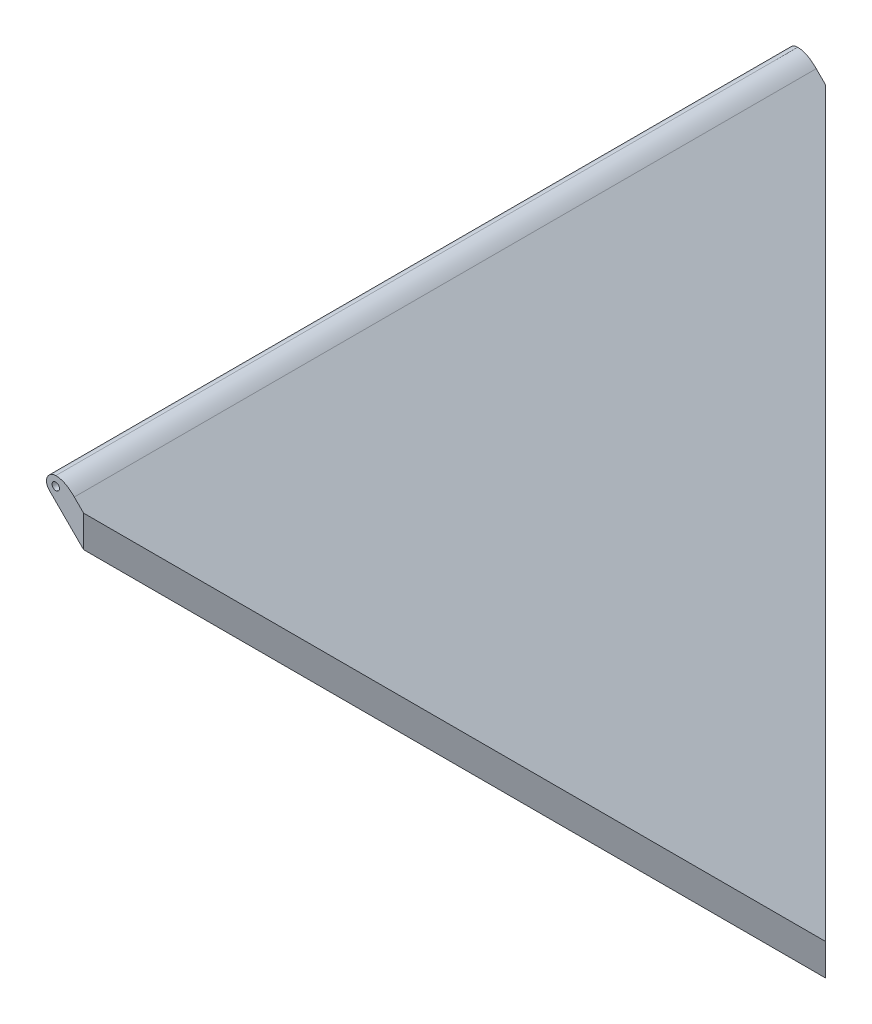
ISO-10303-21;
HEADER;
FILE_DESCRIPTION(('STEP AP214'),'2;1');
FILE_NAME('part.step','',(''),(''),'','','');
FILE_SCHEMA(('AUTOMOTIVE_DESIGN { 1 0 10303 214 1 1 1 1 }'));
ENDSEC;
DATA;
#1=APPLICATION_CONTEXT('core data for automotive mechanical design processes');
#2=APPLICATION_PROTOCOL_DEFINITION('international standard','automotive_design',2000,#1);
#3=PRODUCT_CONTEXT('',#1,'mechanical');
#4=PRODUCT('Part','Part','',(#3));
#5=PRODUCT_RELATED_PRODUCT_CATEGORY('part','',(#4));
#6=PRODUCT_DEFINITION_FORMATION('','',#4);
#7=PRODUCT_DEFINITION_CONTEXT('part definition',#1,'design');
#8=PRODUCT_DEFINITION('design','',#6,#7);
#9=PRODUCT_DEFINITION_SHAPE('','',#8);
#10=(LENGTH_UNIT() NAMED_UNIT(*) SI_UNIT(.MILLI.,.METRE.));
#11=(NAMED_UNIT(*) PLANE_ANGLE_UNIT() SI_UNIT($,.RADIAN.));
#12=(NAMED_UNIT(*) SI_UNIT($,.STERADIAN.) SOLID_ANGLE_UNIT());
#13=UNCERTAINTY_MEASURE_WITH_UNIT(LENGTH_MEASURE(1.E-05),#10,'distance_accuracy_value','');
#14=(GEOMETRIC_REPRESENTATION_CONTEXT(3) GLOBAL_UNCERTAINTY_ASSIGNED_CONTEXT((#13)) GLOBAL_UNIT_ASSIGNED_CONTEXT((#10,
#11,#12)) REPRESENTATION_CONTEXT('',''));
#15=CARTESIAN_POINT('',(0.,0.,0.));
#16=DIRECTION('',(0.,0.,1.));
#17=DIRECTION('',(1.,0.,0.));
#18=AXIS2_PLACEMENT_3D('',#15,#16,#17);
#19=CARTESIAN_POINT('',(0.,0.,0.));
#20=DIRECTION('',(-0.707106781186548,0.,-0.707106781186547));
#21=DIRECTION('',(-0.707106781186547,0.,0.707106781186548));
#22=AXIS2_PLACEMENT_3D('',#19,#20,#21);
#23=PLANE('',#22);
#24=DIRECTION('',(0.,-1.,0.));
#25=VECTOR('',#24,1.);
#26=CARTESIAN_POINT('',(0.,0.,0.));
#27=LINE('',#26,#25);
#28=CARTESIAN_POINT('',(-2.83661982791727E-11,-256.249999999977,2.8421709430404E-11));
#29=VERTEX_POINT('',#28);
#30=CARTESIAN_POINT('',(-2.83939538547884E-11,-277.588834764804,2.8421709430404E-11));
#31=VERTEX_POINT('',#30);
#32=EDGE_CURVE('E168',#29,#31,#27,.T.);
#33=ORIENTED_EDGE('',*,*,#32,.F.);
#34=DIRECTION('',(-0.577350269189622,0.577350269189634,0.577350269189622));
#35=VECTOR('',#34,1.);
#36=CARTESIAN_POINT('',(-91.6666666666691,-164.583333333335,91.6666666666692));
#37=LINE('',#36,#35);
#38=CARTESIAN_POINT('',(-250.,-6.25000000000076,250.));
#39=VERTEX_POINT('',#38);
#40=EDGE_CURVE('E12',#29,#39,#37,.T.);
#41=ORIENTED_EDGE('',*,*,#40,.T.);
#42=DIRECTION('',(0.,1.,0.));
#43=VECTOR('',#42,1.);
#44=CARTESIAN_POINT('',(-250.,-357.97280797569,250.));
#45=LINE('',#44,#43);
#46=CARTESIAN_POINT('',(-250.,-27.5888347648319,250.));
#47=VERTEX_POINT('',#46);
#48=EDGE_CURVE('E60',#47,#39,#45,.T.);
#49=ORIENTED_EDGE('',*,*,#48,.F.);
#50=DIRECTION('',(-0.577350269189625,0.577350269189627,0.577350269189625));
#51=VECTOR('',#50,1.);
#52=CARTESIAN_POINT('',(136.922648807238,-414.511483572071,-136.922648807238));
#53=LINE('',#52,#51);
#54=EDGE_CURVE('E169',#31,#47,#53,.T.);
#55=ORIENTED_EDGE('',*,*,#54,.F.);
#56=EDGE_LOOP('',(#33,#41,#49,#55));
#57=FACE_BOUND('',#56,.T.);
#58=ADVANCED_FACE('F42',(#57),#23,.F.);
#59=CARTESIAN_POINT('',(0.,0.,0.));
#60=DIRECTION('',(0.707106781186547,0.,-0.707106781186548));
#61=DIRECTION('',(-0.707106781186548,0.,-0.707106781186547));
#62=AXIS2_PLACEMENT_3D('',#59,#60,#61);
#63=PLANE('',#62);
#64=ORIENTED_EDGE('',*,*,#32,.T.);
#65=DIRECTION('',(-0.577350269189625,0.577350269189627,-0.577350269189625));
#66=VECTOR('',#65,1.);
#67=CARTESIAN_POINT('',(-29.7440178594283,-247.844816905404,-29.7440178594283));
#68=LINE('',#67,#66);
#69=CARTESIAN_POINT('',(-250.,-27.588834764832,-250.));
#70=VERTEX_POINT('',#69);
#71=EDGE_CURVE('E46',#31,#70,#68,.T.);
#72=ORIENTED_EDGE('',*,*,#71,.T.);
#73=DIRECTION('',(0.,1.,0.));
#74=VECTOR('',#73,1.);
#75=CARTESIAN_POINT('',(-250.,-357.97280797569,-250.));
#76=LINE('',#75,#74);
#77=CARTESIAN_POINT('',(-250.,-6.25000000000038,-250.));
#78=VERTEX_POINT('',#77);
#79=EDGE_CURVE('E52',#70,#78,#76,.T.);
#80=ORIENTED_EDGE('',*,*,#79,.T.);
#81=DIRECTION('',(-0.577350269189622,0.577350269189634,-0.577350269189622));
#82=VECTOR('',#81,1.);
#83=CARTESIAN_POINT('',(-258.333333333334,2.08333333333316,-258.333333333333));
#84=LINE('',#83,#82);
#85=EDGE_CURVE('E104',#29,#78,#84,.T.);
#86=ORIENTED_EDGE('',*,*,#85,.F.);
#87=EDGE_LOOP('',(#64,#72,#80,#86));
#88=FACE_BOUND('',#87,.T.);
#89=ADVANCED_FACE('F44',(#88),#63,.T.);
#90=CARTESIAN_POINT('',(-268.75,0.,-230.));
#91=DIRECTION('',(0.,0.,-1.));
#92=DIRECTION('',(1.,0.,0.));
#93=AXIS2_PLACEMENT_3D('',#90,#91,#92);
#94=PLANE('',#93);
#95=CARTESIAN_POINT('',(-268.75,0.,-230.));
#96=DIRECTION('',(0.,0.,1.));
#97=DIRECTION('',(1.,0.,0.));
#98=AXIS2_PLACEMENT_3D('',#95,#96,#97);
#99=CIRCLE('',#98,2.50000000000002);
#100=CARTESIAN_POINT('',(-266.25,0.,-230.));
#101=VERTEX_POINT('',#100);
#102=EDGE_CURVE('E214',#101,#101,#99,.T.);
#103=ORIENTED_EDGE('',*,*,#102,.F.);
#104=EDGE_LOOP('',(#103));
#105=FACE_BOUND('',#104,.T.);
#106=ADVANCED_FACE('F164',(#105),#94,.T.);
#107=CARTESIAN_POINT('',(-268.75,0.,230.));
#108=DIRECTION('',(0.,0.,1.));
#109=DIRECTION('',(1.,0.,0.));
#110=AXIS2_PLACEMENT_3D('',#107,#108,#109);
#111=PLANE('',#110);
#112=CARTESIAN_POINT('',(-268.75,0.,230.));
#113=DIRECTION('',(0.,0.,1.));
#114=DIRECTION('',(1.,0.,0.));
#115=AXIS2_PLACEMENT_3D('',#112,#113,#114);
#116=CIRCLE('',#115,2.50000000000002);
#117=CARTESIAN_POINT('',(-266.25,0.,230.));
#118=VERTEX_POINT('',#117);
#119=EDGE_CURVE('E123',#118,#118,#116,.T.);
#120=ORIENTED_EDGE('',*,*,#119,.T.);
#121=EDGE_LOOP('',(#120));
#122=FACE_BOUND('',#121,.T.);
#123=ADVANCED_FACE('F232',(#122),#111,.T.);
#124=CARTESIAN_POINT('',(-268.75,0.,-230.));
#125=DIRECTION('',(0.,0.,-1.));
#126=DIRECTION('',(-1.,0.,0.));
#127=AXIS2_PLACEMENT_3D('',#124,#125,#126);
#128=CYLINDRICAL_SURFACE('',#127,2.50000000000002);
#129=ORIENTED_EDGE('',*,*,#102,.T.);
#130=EDGE_LOOP('',(#129));
#131=FACE_BOUND('',#130,.T.);
#132=CARTESIAN_POINT('',(-268.75,0.,-250.));
#133=DIRECTION('',(0.,0.,1.));
#134=DIRECTION('',(1.,0.,0.));
#135=AXIS2_PLACEMENT_3D('',#132,#133,#134);
#136=CIRCLE('',#135,2.50000000000002);
#137=CARTESIAN_POINT('',(-266.25,0.,-250.));
#138=VERTEX_POINT('',#137);
#139=EDGE_CURVE('E173',#138,#138,#136,.T.);
#140=ORIENTED_EDGE('',*,*,#139,.F.);
#141=EDGE_LOOP('',(#140));
#142=FACE_BOUND('',#141,.T.);
#143=ADVANCED_FACE('F149',(#131,#142),#128,.F.);
#144=CARTESIAN_POINT('',(-268.75,0.,-250.));
#145=DIRECTION('',(0.,0.,1.));
#146=DIRECTION('',(1.,0.,0.));
#147=AXIS2_PLACEMENT_3D('',#144,#145,#146);
#148=CYLINDRICAL_SURFACE('',#147,6.25000000000093);
#149=CARTESIAN_POINT('',(-268.75,0.,250.));
#150=DIRECTION('',(0.,0.,1.));
#151=DIRECTION('',(1.,0.,0.));
#152=AXIS2_PLACEMENT_3D('',#149,#150,#151);
#153=CIRCLE('',#152,6.25000000000093);
#154=CARTESIAN_POINT('',(-268.75,6.2500000000007,250.));
#155=VERTEX_POINT('',#154);
#156=CARTESIAN_POINT('',(-273.169417382416,-4.41941738241589,250.));
#157=VERTEX_POINT('',#156);
#158=EDGE_CURVE('E193',#155,#157,#153,.T.);
#159=ORIENTED_EDGE('',*,*,#158,.F.);
#160=DIRECTION('',(0.,0.,1.));
#161=VECTOR('',#160,1.);
#162=CARTESIAN_POINT('',(-268.75,6.25000000000047,-250.));
#163=LINE('',#162,#161);
#164=CARTESIAN_POINT('',(-268.75,6.25000000000093,-250.));
#165=VERTEX_POINT('',#164);
#166=EDGE_CURVE('E106',#165,#155,#163,.T.);
#167=ORIENTED_EDGE('',*,*,#166,.F.);
#168=CARTESIAN_POINT('',(-268.75,0.,-250.));
#169=DIRECTION('',(0.,0.,1.));
#170=DIRECTION('',(1.,0.,0.));
#171=AXIS2_PLACEMENT_3D('',#168,#169,#170);
#172=CIRCLE('',#171,6.25000000000093);
#173=CARTESIAN_POINT('',(-273.169417382417,-4.41941738241642,-250.));
#174=VERTEX_POINT('',#173);
#175=EDGE_CURVE('E121',#165,#174,#172,.T.);
#176=ORIENTED_EDGE('',*,*,#175,.T.);
#177=DIRECTION('',(0.,0.,-1.));
#178=VECTOR('',#177,1.);
#179=CARTESIAN_POINT('',(-273.169417382416,-4.41941738241589,-250.));
#180=LINE('',#179,#178);
#181=EDGE_CURVE('E191',#157,#174,#180,.T.);
#182=ORIENTED_EDGE('',*,*,#181,.F.);
#183=EDGE_LOOP('',(#159,#167,#176,#182));
#184=FACE_BOUND('',#183,.T.);
#185=ADVANCED_FACE('F145',(#184),#148,.T.);
#186=CARTESIAN_POINT('',(80.3839732108572,-357.97280797569,-250.));
#187=DIRECTION('',(0.707106781186549,0.707106781186546,0.));
#188=DIRECTION('',(-0.707106781186546,0.707106781186549,0.));
#189=AXIS2_PLACEMENT_3D('',#186,#187,#188);
#190=PLANE('',#189);
#191=ORIENTED_EDGE('',*,*,#71,.F.);
#192=ORIENTED_EDGE('',*,*,#54,.T.);
#193=DIRECTION('',(-0.707106781186546,0.707106781186549,0.));
#194=VECTOR('',#193,1.);
#195=CARTESIAN_POINT('',(80.3839732108573,-357.97280797569,250.));
#196=LINE('',#195,#194);
#197=EDGE_CURVE('E181',#47,#157,#196,.T.);
#198=ORIENTED_EDGE('',*,*,#197,.T.);
#199=ORIENTED_EDGE('',*,*,#181,.T.);
#200=DIRECTION('',(-0.707106781186546,0.707106781186549,0.));
#201=VECTOR('',#200,1.);
#202=CARTESIAN_POINT('',(80.3839732108572,-357.97280797569,-250.));
#203=LINE('',#202,#201);
#204=EDGE_CURVE('E176',#70,#174,#203,.T.);
#205=ORIENTED_EDGE('',*,*,#204,.F.);
#206=EDGE_LOOP('',(#191,#192,#198,#199,#205));
#207=FACE_BOUND('',#206,.T.);
#208=ADVANCED_FACE('F148',(#207),#190,.F.);
#209=CARTESIAN_POINT('',(-268.75,0.,230.));
#210=DIRECTION('',(0.,0.,1.));
#211=DIRECTION('',(1.,0.,0.));
#212=AXIS2_PLACEMENT_3D('',#209,#210,#211);
#213=CYLINDRICAL_SURFACE('',#212,2.50000000000002);
#214=ORIENTED_EDGE('',*,*,#119,.F.);
#215=EDGE_LOOP('',(#214));
#216=FACE_BOUND('',#215,.T.);
#217=CARTESIAN_POINT('',(-268.75,0.,250.));
#218=DIRECTION('',(0.,0.,1.));
#219=DIRECTION('',(1.,0.,0.));
#220=AXIS2_PLACEMENT_3D('',#217,#218,#219);
#221=CIRCLE('',#220,2.50000000000002);
#222=CARTESIAN_POINT('',(-266.25,0.,250.));
#223=VERTEX_POINT('',#222);
#224=EDGE_CURVE('E127',#223,#223,#221,.T.);
#225=ORIENTED_EDGE('',*,*,#224,.T.);
#226=EDGE_LOOP('',(#225));
#227=FACE_BOUND('',#226,.T.);
#228=ADVANCED_FACE('F141',(#216,#227),#213,.F.);
#229=CARTESIAN_POINT('',(80.3839732108573,-357.97280797569,250.));
#230=DIRECTION('',(0.,0.,-1.));
#231=DIRECTION('',(-1.,0.,0.));
#232=AXIS2_PLACEMENT_3D('',#229,#230,#231);
#233=PLANE('',#232);
#234=ORIENTED_EDGE('',*,*,#224,.F.);
#235=EDGE_LOOP('',(#234));
#236=FACE_BOUND('',#235,.T.);
#237=ORIENTED_EDGE('',*,*,#197,.F.);
#238=ORIENTED_EDGE('',*,*,#48,.T.);
#239=DIRECTION('',(-0.70710678118654,0.707106781186555,0.));
#240=VECTOR('',#239,1.);
#241=CARTESIAN_POINT('',(-262.5,6.24999999999984,250.));
#242=LINE('',#241,#240);
#243=CARTESIAN_POINT('',(-256.250000000007,9.16801357053743E-13,250.));
#244=VERTEX_POINT('',#243);
#245=EDGE_CURVE('E107',#39,#244,#242,.T.);
#246=ORIENTED_EDGE('',*,*,#245,.T.);
#247=CARTESIAN_POINT('',(-268.75,6.25000000000093,250.));
#248=CARTESIAN_POINT('',(-263.635709852691,6.25000000000097,250.));
#249=CARTESIAN_POINT('',(-259.544039229348,3.29403922934057,250.));
#250=CARTESIAN_POINT('',(-256.250000000008,0.,250.));
#251=B_SPLINE_CURVE_WITH_KNOTS('',3,(#247,#248,#249,#250),.UNSPECIFIED.,.F.,.F.,(4,4),(0.,1.),.UNSPECIFIED.);
#252=EDGE_CURVE('E115',#155,#244,#251,.T.);
#253=ORIENTED_EDGE('',*,*,#252,.F.);
#254=ORIENTED_EDGE('',*,*,#158,.T.);
#255=EDGE_LOOP('',(#237,#238,#246,#253,#254));
#256=FACE_BOUND('',#255,.T.);
#257=ADVANCED_FACE('F140',(#236,#256),#233,.F.);
#258=CARTESIAN_POINT('',(-268.75,6.25000000000093,-250.));
#259=CARTESIAN_POINT('',(-263.635709852691,6.25000000000097,-250.));
#260=CARTESIAN_POINT('',(-259.544039229348,3.29403922934057,-250.));
#261=CARTESIAN_POINT('',(-256.250000000008,0.,-250.));
#262=B_SPLINE_CURVE_WITH_KNOTS('',3,(#258,#259,#260,#261),.UNSPECIFIED.,.F.,.F.,(4,4),(0.,1.),.UNSPECIFIED.);
#263=DIRECTION('',(0.,0.,1.));
#264=VECTOR('',#263,1.);
#265=SURFACE_OF_LINEAR_EXTRUSION('',#262,#264);
#266=DIRECTION('',(0.,0.,1.));
#267=VECTOR('',#266,1.);
#268=CARTESIAN_POINT('',(-256.250000000008,0.,-250.));
#269=LINE('',#268,#267);
#270=CARTESIAN_POINT('',(-256.250000000008,0.,-250.));
#271=VERTEX_POINT('',#270);
#272=EDGE_CURVE('E102',#271,#244,#269,.T.);
#273=ORIENTED_EDGE('',*,*,#272,.F.);
#274=EDGE_CURVE('E112',#165,#271,#262,.T.);
#275=ORIENTED_EDGE('',*,*,#274,.F.);
#276=ORIENTED_EDGE('',*,*,#166,.T.);
#277=ORIENTED_EDGE('',*,*,#252,.T.);
#278=EDGE_LOOP('',(#273,#275,#276,#277));
#279=FACE_BOUND('',#278,.T.);
#280=ADVANCED_FACE('F111',(#279),#265,.F.);
#281=CARTESIAN_POINT('',(80.3839732108572,-357.97280797569,-250.));
#282=DIRECTION('',(0.,0.,1.));
#283=DIRECTION('',(0.,-1.,0.));
#284=AXIS2_PLACEMENT_3D('',#281,#282,#283);
#285=PLANE('',#284);
#286=ORIENTED_EDGE('',*,*,#139,.T.);
#287=EDGE_LOOP('',(#286));
#288=FACE_BOUND('',#287,.T.);
#289=ORIENTED_EDGE('',*,*,#79,.F.);
#290=ORIENTED_EDGE('',*,*,#204,.T.);
#291=ORIENTED_EDGE('',*,*,#175,.F.);
#292=ORIENTED_EDGE('',*,*,#274,.T.);
#293=DIRECTION('',(-0.70710678118654,0.707106781186555,0.));
#294=VECTOR('',#293,1.);
#295=CARTESIAN_POINT('',(-262.5,6.24999999999984,-250.));
#296=LINE('',#295,#294);
#297=EDGE_CURVE('E67',#78,#271,#296,.T.);
#298=ORIENTED_EDGE('',*,*,#297,.F.);
#299=EDGE_LOOP('',(#289,#290,#291,#292,#298));
#300=FACE_BOUND('',#299,.T.);
#301=ADVANCED_FACE('F119',(#288,#300),#285,.F.);
#302=CARTESIAN_POINT('',(-262.5,6.24999999999984,-250.));
#303=DIRECTION('',(0.707106781186555,0.70710678118654,0.));
#304=DIRECTION('',(-0.70710678118654,0.707106781186555,0.));
#305=AXIS2_PLACEMENT_3D('',#302,#303,#304);
#306=PLANE('',#305);
#307=ORIENTED_EDGE('',*,*,#40,.F.);
#308=ORIENTED_EDGE('',*,*,#85,.T.);
#309=ORIENTED_EDGE('',*,*,#297,.T.);
#310=ORIENTED_EDGE('',*,*,#272,.T.);
#311=ORIENTED_EDGE('',*,*,#245,.F.);
#312=EDGE_LOOP('',(#307,#308,#309,#310,#311));
#313=FACE_BOUND('',#312,.T.);
#314=ADVANCED_FACE('F100',(#313),#306,.T.);
#315=CLOSED_SHELL('',(#58,#89,#106,#123,#143,#185,#208,#228,#257,#280,#301,#314));
#316=MANIFOLD_SOLID_BREP('B2',#315);
#317=ADVANCED_BREP_SHAPE_REPRESENTATION('',(#18,#316),#14);
#318=SHAPE_DEFINITION_REPRESENTATION(#9,#317);
ENDSEC;
END-ISO-10303-21;
